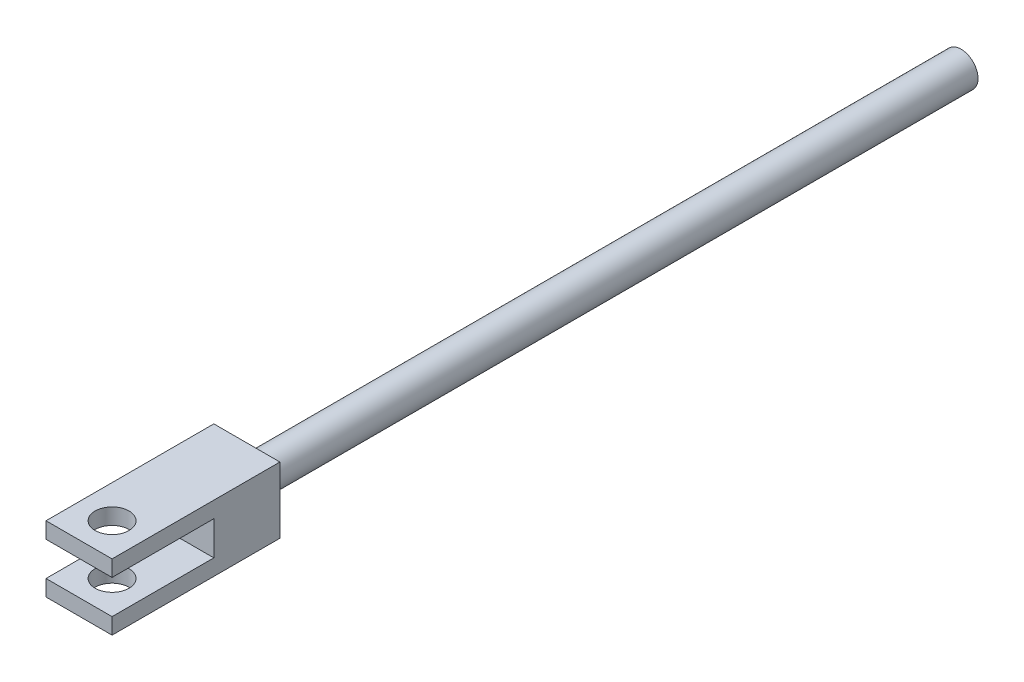
ISO-10303-21;
HEADER;
FILE_DESCRIPTION(('STEP AP214'),'2;1');
FILE_NAME('part.step','',(''),(''),'','','');
FILE_SCHEMA(('AUTOMOTIVE_DESIGN { 1 0 10303 214 1 1 1 1 }'));
ENDSEC;
DATA;
#1=APPLICATION_CONTEXT('core data for automotive mechanical design processes');
#2=APPLICATION_PROTOCOL_DEFINITION('international standard','automotive_design',2000,#1);
#3=PRODUCT_CONTEXT('',#1,'mechanical');
#4=PRODUCT('Part','Part','',(#3));
#5=PRODUCT_RELATED_PRODUCT_CATEGORY('part','',(#4));
#6=PRODUCT_DEFINITION_FORMATION('','',#4);
#7=PRODUCT_DEFINITION_CONTEXT('part definition',#1,'design');
#8=PRODUCT_DEFINITION('design','',#6,#7);
#9=PRODUCT_DEFINITION_SHAPE('','',#8);
#10=(LENGTH_UNIT() NAMED_UNIT(*) SI_UNIT(.MILLI.,.METRE.));
#11=(NAMED_UNIT(*) PLANE_ANGLE_UNIT() SI_UNIT($,.RADIAN.));
#12=(NAMED_UNIT(*) SI_UNIT($,.STERADIAN.) SOLID_ANGLE_UNIT());
#13=UNCERTAINTY_MEASURE_WITH_UNIT(LENGTH_MEASURE(1.E-05),#10,'distance_accuracy_value','');
#14=(GEOMETRIC_REPRESENTATION_CONTEXT(3) GLOBAL_UNCERTAINTY_ASSIGNED_CONTEXT((#13)) GLOBAL_UNIT_ASSIGNED_CONTEXT((#10,
#11,#12)) REPRESENTATION_CONTEXT('',''));
#15=CARTESIAN_POINT('',(0.,0.,0.));
#16=DIRECTION('',(0.,0.,1.));
#17=DIRECTION('',(1.,0.,0.));
#18=AXIS2_PLACEMENT_3D('',#15,#16,#17);
#19=CARTESIAN_POINT('',(0.,0.,23.876));
#20=DIRECTION('',(0.,0.,1.));
#21=DIRECTION('',(1.,0.,0.));
#22=AXIS2_PLACEMENT_3D('',#19,#20,#21);
#23=PLANE('',#22);
#24=DIRECTION('',(1.,0.,0.));
#25=VECTOR('',#24,1.);
#26=CARTESIAN_POINT('',(-4.699,2.413,23.876));
#27=LINE('',#26,#25);
#28=CARTESIAN_POINT('',(-4.699,2.413,23.876));
#29=VERTEX_POINT('',#28);
#30=CARTESIAN_POINT('',(4.699,2.413,23.876));
#31=VERTEX_POINT('',#30);
#32=EDGE_CURVE('E142',#29,#31,#27,.T.);
#33=ORIENTED_EDGE('',*,*,#32,.T.);
#34=DIRECTION('',(0.,1.,0.));
#35=VECTOR('',#34,1.);
#36=CARTESIAN_POINT('',(4.699,4.699,23.876));
#37=LINE('',#36,#35);
#38=CARTESIAN_POINT('',(4.699,4.699,23.876));
#39=VERTEX_POINT('',#38);
#40=EDGE_CURVE('E87',#31,#39,#37,.T.);
#41=ORIENTED_EDGE('',*,*,#40,.T.);
#42=DIRECTION('',(-1.,0.,0.));
#43=VECTOR('',#42,1.);
#44=CARTESIAN_POINT('',(-4.699,4.699,23.876));
#45=LINE('',#44,#43);
#46=CARTESIAN_POINT('',(-4.699,4.699,23.876));
#47=VERTEX_POINT('',#46);
#48=EDGE_CURVE('E149',#39,#47,#45,.T.);
#49=ORIENTED_EDGE('',*,*,#48,.T.);
#50=DIRECTION('',(0.,-1.,0.));
#51=VECTOR('',#50,1.);
#52=CARTESIAN_POINT('',(-4.699,4.699,23.876));
#53=LINE('',#52,#51);
#54=EDGE_CURVE('E151',#47,#29,#53,.T.);
#55=ORIENTED_EDGE('',*,*,#54,.T.);
#56=EDGE_LOOP('',(#33,#41,#49,#55));
#57=FACE_BOUND('',#56,.T.);
#58=ADVANCED_FACE('F32',(#57),#23,.T.);
#59=CARTESIAN_POINT('',(4.699,4.699,23.876));
#60=DIRECTION('',(-1.,0.,0.));
#61=DIRECTION('',(0.,-1.,0.));
#62=AXIS2_PLACEMENT_3D('',#59,#60,#61);
#63=PLANE('',#62);
#64=ORIENTED_EDGE('',*,*,#40,.F.);
#65=DIRECTION('',(0.,0.,1.));
#66=VECTOR('',#65,1.);
#67=CARTESIAN_POINT('',(4.699,2.413,23.876));
#68=LINE('',#67,#66);
#69=CARTESIAN_POINT('',(4.699,2.413,9.398));
#70=VERTEX_POINT('',#69);
#71=EDGE_CURVE('E131',#70,#31,#68,.T.);
#72=ORIENTED_EDGE('',*,*,#71,.F.);
#73=DIRECTION('',(0.,1.,0.));
#74=VECTOR('',#73,1.);
#75=CARTESIAN_POINT('',(4.699,2.413,9.398));
#76=LINE('',#75,#74);
#77=CARTESIAN_POINT('',(4.699,-2.413,9.398));
#78=VERTEX_POINT('',#77);
#79=EDGE_CURVE('E133',#78,#70,#76,.T.);
#80=ORIENTED_EDGE('',*,*,#79,.F.);
#81=DIRECTION('',(0.,0.,-1.));
#82=VECTOR('',#81,1.);
#83=CARTESIAN_POINT('',(4.699,-2.413,23.876));
#84=LINE('',#83,#82);
#85=CARTESIAN_POINT('',(4.699,-2.413,23.876));
#86=VERTEX_POINT('',#85);
#87=EDGE_CURVE('E112',#86,#78,#84,.T.);
#88=ORIENTED_EDGE('',*,*,#87,.F.);
#89=CARTESIAN_POINT('',(4.699,-4.699,23.876));
#90=VERTEX_POINT('',#89);
#91=EDGE_CURVE('E147',#90,#86,#37,.T.);
#92=ORIENTED_EDGE('',*,*,#91,.F.);
#93=DIRECTION('',(0.,0.,-1.));
#94=VECTOR('',#93,1.);
#95=CARTESIAN_POINT('',(4.699,-4.699,23.876));
#96=LINE('',#95,#94);
#97=CARTESIAN_POINT('',(4.699,-4.699,0.));
#98=VERTEX_POINT('',#97);
#99=EDGE_CURVE('E155',#90,#98,#96,.T.);
#100=ORIENTED_EDGE('',*,*,#99,.T.);
#101=DIRECTION('',(0.,1.,0.));
#102=VECTOR('',#101,1.);
#103=CARTESIAN_POINT('',(4.699,4.699,0.));
#104=LINE('',#103,#102);
#105=CARTESIAN_POINT('',(4.699,4.699,0.));
#106=VERTEX_POINT('',#105);
#107=EDGE_CURVE('E144',#98,#106,#104,.T.);
#108=ORIENTED_EDGE('',*,*,#107,.T.);
#109=DIRECTION('',(0.,0.,-1.));
#110=VECTOR('',#109,1.);
#111=CARTESIAN_POINT('',(4.699,4.699,23.876));
#112=LINE('',#111,#110);
#113=EDGE_CURVE('E41',#39,#106,#112,.T.);
#114=ORIENTED_EDGE('',*,*,#113,.F.);
#115=EDGE_LOOP('',(#64,#72,#80,#88,#92,#100,#108,#114));
#116=FACE_BOUND('',#115,.T.);
#117=ADVANCED_FACE('F34',(#116),#63,.F.);
#118=CARTESIAN_POINT('',(-4.699,4.699,23.876));
#119=DIRECTION('',(0.,-1.,0.));
#120=DIRECTION('',(0.,0.,-1.));
#121=AXIS2_PLACEMENT_3D('',#118,#119,#120);
#122=PLANE('',#121);
#123=CARTESIAN_POINT('',(0.,4.699,19.177));
#124=DIRECTION('',(0.,1.,0.));
#125=DIRECTION('',(0.,0.,1.));
#126=AXIS2_PLACEMENT_3D('',#123,#124,#125);
#127=CIRCLE('',#126,2.413);
#128=CARTESIAN_POINT('',(0.,4.699,21.59));
#129=VERTEX_POINT('',#128);
#130=EDGE_CURVE('E223',#129,#129,#127,.T.);
#131=ORIENTED_EDGE('',*,*,#130,.F.);
#132=EDGE_LOOP('',(#131));
#133=FACE_BOUND('',#132,.T.);
#134=DIRECTION('',(-1.,0.,0.));
#135=VECTOR('',#134,1.);
#136=CARTESIAN_POINT('',(-4.699,4.699,0.));
#137=LINE('',#136,#135);
#138=CARTESIAN_POINT('',(-4.699,4.699,0.));
#139=VERTEX_POINT('',#138);
#140=EDGE_CURVE('E158',#106,#139,#137,.T.);
#141=ORIENTED_EDGE('',*,*,#140,.T.);
#142=DIRECTION('',(0.,0.,-1.));
#143=VECTOR('',#142,1.);
#144=CARTESIAN_POINT('',(-4.699,4.699,23.876));
#145=LINE('',#144,#143);
#146=EDGE_CURVE('E166',#47,#139,#145,.T.);
#147=ORIENTED_EDGE('',*,*,#146,.F.);
#148=ORIENTED_EDGE('',*,*,#48,.F.);
#149=ORIENTED_EDGE('',*,*,#113,.T.);
#150=EDGE_LOOP('',(#141,#147,#148,#149));
#151=FACE_BOUND('',#150,.T.);
#152=ADVANCED_FACE('F171',(#133,#151),#122,.F.);
#153=CARTESIAN_POINT('',(-4.699,4.699,23.876));
#154=DIRECTION('',(1.,0.,0.));
#155=DIRECTION('',(0.,1.,0.));
#156=AXIS2_PLACEMENT_3D('',#153,#154,#155);
#157=PLANE('',#156);
#158=DIRECTION('',(0.,1.,0.));
#159=VECTOR('',#158,1.);
#160=CARTESIAN_POINT('',(-4.699,2.413,9.398));
#161=LINE('',#160,#159);
#162=CARTESIAN_POINT('',(-4.699,-2.413,9.398));
#163=VERTEX_POINT('',#162);
#164=CARTESIAN_POINT('',(-4.699,2.413,9.398));
#165=VERTEX_POINT('',#164);
#166=EDGE_CURVE('E120',#163,#165,#161,.T.);
#167=ORIENTED_EDGE('',*,*,#166,.T.);
#168=DIRECTION('',(0.,0.,1.));
#169=VECTOR('',#168,1.);
#170=CARTESIAN_POINT('',(-4.699,2.413,23.876));
#171=LINE('',#170,#169);
#172=EDGE_CURVE('E125',#165,#29,#171,.T.);
#173=ORIENTED_EDGE('',*,*,#172,.T.);
#174=ORIENTED_EDGE('',*,*,#54,.F.);
#175=ORIENTED_EDGE('',*,*,#146,.T.);
#176=DIRECTION('',(0.,-1.,0.));
#177=VECTOR('',#176,1.);
#178=CARTESIAN_POINT('',(-4.699,4.699,0.));
#179=LINE('',#178,#177);
#180=CARTESIAN_POINT('',(-4.699,-4.699,0.));
#181=VERTEX_POINT('',#180);
#182=EDGE_CURVE('E160',#139,#181,#179,.T.);
#183=ORIENTED_EDGE('',*,*,#182,.T.);
#184=DIRECTION('',(0.,0.,-1.));
#185=VECTOR('',#184,1.);
#186=CARTESIAN_POINT('',(-4.699,-4.699,23.876));
#187=LINE('',#186,#185);
#188=CARTESIAN_POINT('',(-4.699,-4.699,23.876));
#189=VERTEX_POINT('',#188);
#190=EDGE_CURVE('E164',#189,#181,#187,.T.);
#191=ORIENTED_EDGE('',*,*,#190,.F.);
#192=CARTESIAN_POINT('',(-4.699,-2.413,23.876));
#193=VERTEX_POINT('',#192);
#194=EDGE_CURVE('E130',#193,#189,#53,.T.);
#195=ORIENTED_EDGE('',*,*,#194,.F.);
#196=DIRECTION('',(0.,0.,-1.));
#197=VECTOR('',#196,1.);
#198=CARTESIAN_POINT('',(-4.699,-2.413,23.876));
#199=LINE('',#198,#197);
#200=EDGE_CURVE('E49',#193,#163,#199,.T.);
#201=ORIENTED_EDGE('',*,*,#200,.T.);
#202=EDGE_LOOP('',(#167,#173,#174,#175,#183,#191,#195,#201));
#203=FACE_BOUND('',#202,.T.);
#204=ADVANCED_FACE('F128',(#203),#157,.F.);
#205=CARTESIAN_POINT('',(-4.699,-4.699,23.876));
#206=DIRECTION('',(0.,1.,0.));
#207=DIRECTION('',(0.,0.,1.));
#208=AXIS2_PLACEMENT_3D('',#205,#206,#207);
#209=PLANE('',#208);
#210=CARTESIAN_POINT('',(0.,-4.699,19.177));
#211=DIRECTION('',(0.,1.,0.));
#212=DIRECTION('',(0.,0.,1.));
#213=AXIS2_PLACEMENT_3D('',#210,#211,#212);
#214=CIRCLE('',#213,2.413);
#215=CARTESIAN_POINT('',(0.,-4.699,21.59));
#216=VERTEX_POINT('',#215);
#217=EDGE_CURVE('E221',#216,#216,#214,.T.);
#218=ORIENTED_EDGE('',*,*,#217,.T.);
#219=EDGE_LOOP('',(#218));
#220=FACE_BOUND('',#219,.T.);
#221=DIRECTION('',(1.,0.,0.));
#222=VECTOR('',#221,1.);
#223=CARTESIAN_POINT('',(-4.699,-4.699,0.));
#224=LINE('',#223,#222);
#225=EDGE_CURVE('E79',#181,#98,#224,.T.);
#226=ORIENTED_EDGE('',*,*,#225,.T.);
#227=ORIENTED_EDGE('',*,*,#99,.F.);
#228=DIRECTION('',(1.,0.,0.));
#229=VECTOR('',#228,1.);
#230=CARTESIAN_POINT('',(-4.699,-4.699,23.876));
#231=LINE('',#230,#229);
#232=EDGE_CURVE('E58',#189,#90,#231,.T.);
#233=ORIENTED_EDGE('',*,*,#232,.F.);
#234=ORIENTED_EDGE('',*,*,#190,.T.);
#235=EDGE_LOOP('',(#226,#227,#233,#234));
#236=FACE_BOUND('',#235,.T.);
#237=ADVANCED_FACE('F180',(#220,#236),#209,.F.);
#238=DIRECTION('',(1.,0.,0.));
#239=VECTOR('',#238,1.);
#240=CARTESIAN_POINT('',(-4.699,-2.413,23.876));
#241=LINE('',#240,#239);
#242=EDGE_CURVE('E117',#193,#86,#241,.T.);
#243=ORIENTED_EDGE('',*,*,#242,.F.);
#244=ORIENTED_EDGE('',*,*,#194,.T.);
#245=ORIENTED_EDGE('',*,*,#232,.T.);
#246=ORIENTED_EDGE('',*,*,#91,.T.);
#247=EDGE_LOOP('',(#243,#244,#245,#246));
#248=FACE_BOUND('',#247,.T.);
#249=ADVANCED_FACE('F181',(#248),#23,.T.);
#250=CARTESIAN_POINT('',(0.,0.,0.));
#251=DIRECTION('',(0.,0.,1.));
#252=DIRECTION('',(1.,0.,0.));
#253=AXIS2_PLACEMENT_3D('',#250,#251,#252);
#254=PLANE('',#253);
#255=CARTESIAN_POINT('',(0.,0.,0.));
#256=DIRECTION('',(0.,0.,-1.));
#257=DIRECTION('',(-1.,0.,0.));
#258=AXIS2_PLACEMENT_3D('',#255,#256,#257);
#259=CIRCLE('',#258,2.413);
#260=CARTESIAN_POINT('',(-2.413,0.,0.));
#261=VERTEX_POINT('',#260);
#262=EDGE_CURVE('E11',#261,#261,#259,.T.);
#263=ORIENTED_EDGE('',*,*,#262,.F.);
#264=EDGE_LOOP('',(#263));
#265=FACE_BOUND('',#264,.T.);
#266=ORIENTED_EDGE('',*,*,#107,.F.);
#267=ORIENTED_EDGE('',*,*,#225,.F.);
#268=ORIENTED_EDGE('',*,*,#182,.F.);
#269=ORIENTED_EDGE('',*,*,#140,.F.);
#270=EDGE_LOOP('',(#266,#267,#268,#269));
#271=FACE_BOUND('',#270,.T.);
#272=ADVANCED_FACE('F177',(#265,#271),#254,.F.);
#273=CARTESIAN_POINT('',(-4.699,2.413,23.876));
#274=DIRECTION('',(0.,1.,0.));
#275=DIRECTION('',(-1.,0.,0.));
#276=AXIS2_PLACEMENT_3D('',#273,#274,#275);
#277=PLANE('',#276);
#278=CARTESIAN_POINT('',(0.,2.413,19.177));
#279=DIRECTION('',(0.,1.,0.));
#280=DIRECTION('',(-1.,0.,0.));
#281=AXIS2_PLACEMENT_3D('',#278,#279,#280);
#282=CIRCLE('',#281,2.413);
#283=CARTESIAN_POINT('',(-2.413,2.413,19.177));
#284=VERTEX_POINT('',#283);
#285=EDGE_CURVE('E136',#284,#284,#282,.T.);
#286=ORIENTED_EDGE('',*,*,#285,.T.);
#287=EDGE_LOOP('',(#286));
#288=FACE_BOUND('',#287,.T.);
#289=ORIENTED_EDGE('',*,*,#71,.T.);
#290=ORIENTED_EDGE('',*,*,#32,.F.);
#291=ORIENTED_EDGE('',*,*,#172,.F.);
#292=DIRECTION('',(1.,0.,0.));
#293=VECTOR('',#292,1.);
#294=CARTESIAN_POINT('',(-4.699,2.413,9.398));
#295=LINE('',#294,#293);
#296=EDGE_CURVE('E116',#165,#70,#295,.T.);
#297=ORIENTED_EDGE('',*,*,#296,.T.);
#298=EDGE_LOOP('',(#289,#290,#291,#297));
#299=FACE_BOUND('',#298,.T.);
#300=ADVANCED_FACE('F188',(#288,#299),#277,.F.);
#301=CARTESIAN_POINT('',(-4.699,2.413,9.398));
#302=DIRECTION('',(0.,0.,-1.));
#303=DIRECTION('',(-1.,0.,0.));
#304=AXIS2_PLACEMENT_3D('',#301,#302,#303);
#305=PLANE('',#304);
#306=ORIENTED_EDGE('',*,*,#79,.T.);
#307=ORIENTED_EDGE('',*,*,#296,.F.);
#308=ORIENTED_EDGE('',*,*,#166,.F.);
#309=DIRECTION('',(1.,0.,0.));
#310=VECTOR('',#309,1.);
#311=CARTESIAN_POINT('',(-4.699,-2.413,9.398));
#312=LINE('',#311,#310);
#313=EDGE_CURVE('E108',#163,#78,#312,.T.);
#314=ORIENTED_EDGE('',*,*,#313,.T.);
#315=EDGE_LOOP('',(#306,#307,#308,#314));
#316=FACE_BOUND('',#315,.T.);
#317=ADVANCED_FACE('F121',(#316),#305,.F.);
#318=CARTESIAN_POINT('',(-4.699,-2.413,23.876));
#319=DIRECTION('',(0.,-1.,0.));
#320=DIRECTION('',(1.,0.,0.));
#321=AXIS2_PLACEMENT_3D('',#318,#319,#320);
#322=PLANE('',#321);
#323=CARTESIAN_POINT('',(0.,-2.413,19.177));
#324=DIRECTION('',(0.,-1.,0.));
#325=DIRECTION('',(1.,0.,0.));
#326=AXIS2_PLACEMENT_3D('',#323,#324,#325);
#327=CIRCLE('',#326,2.413);
#328=CARTESIAN_POINT('',(2.413,-2.413,19.177));
#329=VERTEX_POINT('',#328);
#330=EDGE_CURVE('E36',#329,#329,#327,.T.);
#331=ORIENTED_EDGE('',*,*,#330,.T.);
#332=EDGE_LOOP('',(#331));
#333=FACE_BOUND('',#332,.T.);
#334=ORIENTED_EDGE('',*,*,#87,.T.);
#335=ORIENTED_EDGE('',*,*,#313,.F.);
#336=ORIENTED_EDGE('',*,*,#200,.F.);
#337=ORIENTED_EDGE('',*,*,#242,.T.);
#338=EDGE_LOOP('',(#334,#335,#336,#337));
#339=FACE_BOUND('',#338,.T.);
#340=ADVANCED_FACE('F110',(#333,#339),#322,.F.);
#341=CARTESIAN_POINT('',(0.,-4.699,19.177));
#342=DIRECTION('',(0.,1.,0.));
#343=DIRECTION('',(0.,0.,1.));
#344=AXIS2_PLACEMENT_3D('',#341,#342,#343);
#345=CYLINDRICAL_SURFACE('',#344,2.413);
#346=ORIENTED_EDGE('',*,*,#217,.F.);
#347=EDGE_LOOP('',(#346));
#348=FACE_BOUND('',#347,.T.);
#349=ORIENTED_EDGE('',*,*,#330,.F.);
#350=EDGE_LOOP('',(#349));
#351=FACE_BOUND('',#350,.T.);
#352=ADVANCED_FACE('F212',(#348,#351),#345,.F.);
#353=ORIENTED_EDGE('',*,*,#130,.T.);
#354=EDGE_LOOP('',(#353));
#355=FACE_BOUND('',#354,.T.);
#356=ORIENTED_EDGE('',*,*,#285,.F.);
#357=EDGE_LOOP('',(#356));
#358=FACE_BOUND('',#357,.T.);
#359=ADVANCED_FACE('F209',(#355,#358),#345,.F.);
#360=CARTESIAN_POINT('',(0.,0.,-101.6));
#361=DIRECTION('',(0.,0.,1.));
#362=DIRECTION('',(1.,0.,0.));
#363=AXIS2_PLACEMENT_3D('',#360,#361,#362);
#364=CYLINDRICAL_SURFACE('',#363,2.413);
#365=CARTESIAN_POINT('',(0.,0.,-101.6));
#366=DIRECTION('',(0.,0.,-1.));
#367=DIRECTION('',(-1.,0.,0.));
#368=AXIS2_PLACEMENT_3D('',#365,#366,#367);
#369=CIRCLE('',#368,2.413);
#370=CARTESIAN_POINT('',(-2.413,0.,-101.6));
#371=VERTEX_POINT('',#370);
#372=EDGE_CURVE('E227',#371,#371,#369,.T.);
#373=ORIENTED_EDGE('',*,*,#372,.F.);
#374=EDGE_LOOP('',(#373));
#375=FACE_BOUND('',#374,.T.);
#376=ORIENTED_EDGE('',*,*,#262,.T.);
#377=EDGE_LOOP('',(#376));
#378=FACE_BOUND('',#377,.T.);
#379=ADVANCED_FACE('F234',(#375,#378),#364,.T.);
#380=CARTESIAN_POINT('',(0.,0.,-101.6));
#381=DIRECTION('',(0.,0.,-1.));
#382=DIRECTION('',(-1.,0.,0.));
#383=AXIS2_PLACEMENT_3D('',#380,#381,#382);
#384=PLANE('',#383);
#385=ORIENTED_EDGE('',*,*,#372,.T.);
#386=EDGE_LOOP('',(#385));
#387=FACE_BOUND('',#386,.T.);
#388=ADVANCED_FACE('F232',(#387),#384,.T.);
#389=CLOSED_SHELL('',(#58,#117,#152,#204,#237,#249,#272,#300,#317,#340,#352,#359,#379,#388));
#390=MANIFOLD_SOLID_BREP('B2',#389);
#391=ADVANCED_BREP_SHAPE_REPRESENTATION('',(#18,#390),#14);
#392=SHAPE_DEFINITION_REPRESENTATION(#9,#391);
ENDSEC;
END-ISO-10303-21;
